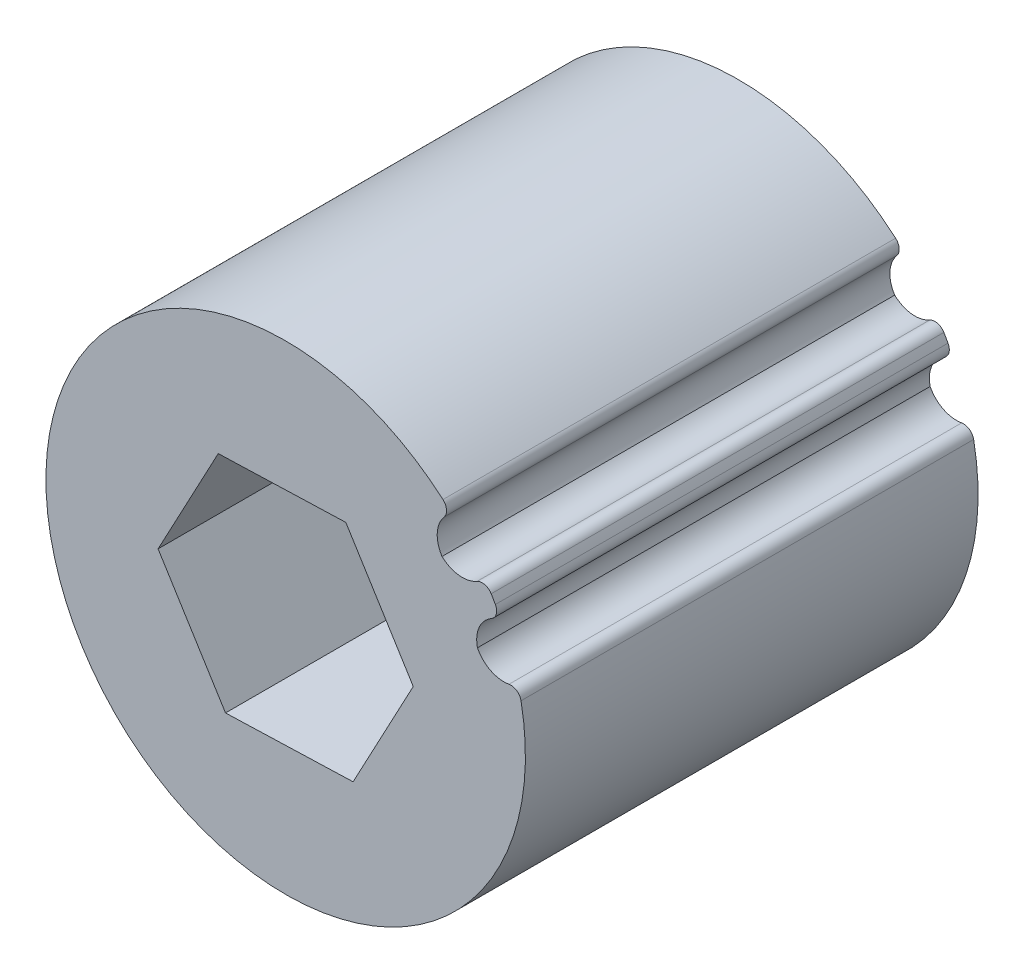
ISO-10303-21;
HEADER;
FILE_DESCRIPTION(('STEP AP214'),'2;1');
FILE_NAME('part.step','',(''),(''),'','','');
FILE_SCHEMA(('AUTOMOTIVE_DESIGN { 1 0 10303 214 1 1 1 1 }'));
ENDSEC;
DATA;
#1=APPLICATION_CONTEXT('core data for automotive mechanical design processes');
#2=APPLICATION_PROTOCOL_DEFINITION('international standard','automotive_design',2000,#1);
#3=PRODUCT_CONTEXT('',#1,'mechanical');
#4=PRODUCT('Part','Part','',(#3));
#5=PRODUCT_RELATED_PRODUCT_CATEGORY('part','',(#4));
#6=PRODUCT_DEFINITION_FORMATION('','',#4);
#7=PRODUCT_DEFINITION_CONTEXT('part definition',#1,'design');
#8=PRODUCT_DEFINITION('design','',#6,#7);
#9=PRODUCT_DEFINITION_SHAPE('','',#8);
#10=(LENGTH_UNIT() NAMED_UNIT(*) SI_UNIT(.MILLI.,.METRE.));
#11=(NAMED_UNIT(*) PLANE_ANGLE_UNIT() SI_UNIT($,.RADIAN.));
#12=(NAMED_UNIT(*) SI_UNIT($,.STERADIAN.) SOLID_ANGLE_UNIT());
#13=UNCERTAINTY_MEASURE_WITH_UNIT(LENGTH_MEASURE(1.E-05),#10,'distance_accuracy_value','');
#14=(GEOMETRIC_REPRESENTATION_CONTEXT(3) GLOBAL_UNCERTAINTY_ASSIGNED_CONTEXT((#13)) GLOBAL_UNIT_ASSIGNED_CONTEXT((#10,
#11,#12)) REPRESENTATION_CONTEXT('',''));
#15=CARTESIAN_POINT('',(0.,0.,0.));
#16=DIRECTION('',(0.,0.,1.));
#17=DIRECTION('',(1.,0.,0.));
#18=AXIS2_PLACEMENT_3D('',#15,#16,#17);
#19=CARTESIAN_POINT('',(0.,0.,-100.));
#20=DIRECTION('',(0.,0.,1.));
#21=DIRECTION('',(1.,0.,0.));
#22=AXIS2_PLACEMENT_3D('',#19,#20,#21);
#23=CYLINDRICAL_SURFACE('',#22,13.77);
#24=DIRECTION('',(0.,0.,1.));
#25=VECTOR('',#24,1.);
#26=CARTESIAN_POINT('',(11.8039555341255,7.09080628338531,100.));
#27=LINE('',#26,#25);
#28=CARTESIAN_POINT('',(11.8039555341241,7.0908062833799,-74.000108));
#29=VERTEX_POINT('',#28);
#30=CARTESIAN_POINT('',(11.8039555341248,7.09080628338263,-100.));
#31=VERTEX_POINT('',#30);
#32=EDGE_CURVE('E193',#29,#31,#27,.F.);
#33=ORIENTED_EDGE('',*,*,#32,.F.);
#34=CARTESIAN_POINT('',(0.,0.,-74.000108));
#35=DIRECTION('',(0.,0.,1.));
#36=DIRECTION('',(1.,0.,0.));
#37=AXIS2_PLACEMENT_3D('',#34,#35,#36);
#38=CIRCLE('',#37,13.7699999999999);
#39=CARTESIAN_POINT('',(12.0427961417845,6.67712221600126,-74.000108));
#40=VERTEX_POINT('',#39);
#41=EDGE_CURVE('E151',#40,#29,#38,.T.);
#42=ORIENTED_EDGE('',*,*,#41,.F.);
#43=DIRECTION('',(0.,0.,1.));
#44=VECTOR('',#43,1.);
#45=CARTESIAN_POINT('',(12.0427961417844,6.67712221600442,100.));
#46=LINE('',#45,#44);
#47=CARTESIAN_POINT('',(12.0427961417845,6.67712221600286,-100.));
#48=VERTEX_POINT('',#47);
#49=EDGE_CURVE('E196',#48,#40,#46,.T.);
#50=ORIENTED_EDGE('',*,*,#49,.F.);
#51=CARTESIAN_POINT('',(0.,0.,-100.));
#52=DIRECTION('',(0.,0.,1.));
#53=DIRECTION('',(1.,0.,0.));
#54=AXIS2_PLACEMENT_3D('',#51,#52,#53);
#55=CIRCLE('',#54,13.77);
#56=EDGE_CURVE('E198',#48,#31,#55,.T.);
#57=ORIENTED_EDGE('',*,*,#56,.T.);
#58=EDGE_LOOP('',(#33,#42,#50,#57));
#59=FACE_BOUND('',#58,.T.);
#60=ADVANCED_FACE('F35',(#59),#23,.T.);
#61=CARTESIAN_POINT('',(11.51893013678,6.386664975088,100.));
#62=DIRECTION('',(0.,0.,1.));
#63=DIRECTION('',(1.,0.,0.));
#64=AXIS2_PLACEMENT_3D('',#61,#62,#63);
#65=CYLINDRICAL_SURFACE('',#64,0.599);
#66=ORIENTED_EDGE('',*,*,#49,.T.);
#67=CARTESIAN_POINT('',(11.51893013678,6.386664975088,-74.000108));
#68=DIRECTION('',(0.,0.,1.));
#69=DIRECTION('',(1.,0.,0.));
#70=AXIS2_PLACEMENT_3D('',#67,#68,#69);
#71=CIRCLE('',#70,0.599);
#72=CARTESIAN_POINT('',(11.8188093902637,5.86813490524408,-74.000108));
#73=VERTEX_POINT('',#72);
#74=EDGE_CURVE('E259',#40,#73,#71,.F.);
#75=ORIENTED_EDGE('',*,*,#74,.T.);
#76=DIRECTION('',(0.,0.,1.));
#77=VECTOR('',#76,1.);
#78=CARTESIAN_POINT('',(11.8188093902618,5.86813490524298,100.));
#79=LINE('',#78,#77);
#80=CARTESIAN_POINT('',(11.8188093902632,5.86813490524489,-100.));
#81=VERTEX_POINT('',#80);
#82=EDGE_CURVE('E185',#73,#81,#79,.F.);
#83=ORIENTED_EDGE('',*,*,#82,.T.);
#84=CARTESIAN_POINT('',(11.51893013678,6.386664975088,-100.));
#85=DIRECTION('',(0.,0.,1.));
#86=DIRECTION('',(1.,0.,0.));
#87=AXIS2_PLACEMENT_3D('',#84,#85,#86);
#88=CIRCLE('',#87,0.599);
#89=EDGE_CURVE('E195',#81,#48,#88,.T.);
#90=ORIENTED_EDGE('',*,*,#89,.T.);
#91=EDGE_LOOP('',(#66,#75,#83,#90));
#92=FACE_BOUND('',#91,.T.);
#93=ADVANCED_FACE('F287',(#92),#65,.T.);
#94=CARTESIAN_POINT('',(11.29047918228,6.782353635325,100.));
#95=DIRECTION('',(0.,0.,1.));
#96=DIRECTION('',(1.,0.,0.));
#97=AXIS2_PLACEMENT_3D('',#94,#95,#96);
#98=CYLINDRICAL_SURFACE('',#97,0.599);
#99=DIRECTION('',(0.,0.,1.));
#100=VECTOR('',#99,1.);
#101=CARTESIAN_POINT('',(10.9913585959105,7.30132172183021,100.));
#102=LINE('',#101,#100);
#103=CARTESIAN_POINT('',(10.9913585959116,7.30132172183042,-100.));
#104=VERTEX_POINT('',#103);
#105=CARTESIAN_POINT('',(10.9913585959114,7.30132172183076,-74.000108));
#106=VERTEX_POINT('',#105);
#107=EDGE_CURVE('E182',#104,#106,#102,.T.);
#108=ORIENTED_EDGE('',*,*,#107,.T.);
#109=CARTESIAN_POINT('',(11.29047918228,6.782353635325,-74.000108));
#110=DIRECTION('',(0.,0.,1.));
#111=DIRECTION('',(1.,0.,0.));
#112=AXIS2_PLACEMENT_3D('',#109,#110,#111);
#113=CIRCLE('',#112,0.599);
#114=EDGE_CURVE('E162',#106,#29,#113,.F.);
#115=ORIENTED_EDGE('',*,*,#114,.T.);
#116=ORIENTED_EDGE('',*,*,#32,.T.);
#117=CARTESIAN_POINT('',(11.29047918228,6.782353635325,-100.));
#118=DIRECTION('',(0.,0.,1.));
#119=DIRECTION('',(1.,0.,0.));
#120=AXIS2_PLACEMENT_3D('',#117,#118,#119);
#121=CIRCLE('',#120,0.599);
#122=EDGE_CURVE('E189',#31,#104,#121,.T.);
#123=ORIENTED_EDGE('',*,*,#122,.T.);
#124=EDGE_LOOP('',(#108,#115,#116,#123));
#125=FACE_BOUND('',#124,.T.);
#126=ADVANCED_FACE('F284',(#125),#98,.T.);
#127=CARTESIAN_POINT('',(12.53189300495,4.775135765078,100.));
#128=DIRECTION('',(0.,0.,1.));
#129=DIRECTION('',(1.,0.,0.));
#130=AXIS2_PLACEMENT_3D('',#127,#128,#129);
#131=CYLINDRICAL_SURFACE('',#130,1.699);
#132=CARTESIAN_POINT('',(12.53189300495,4.775135765078,-74.000108));
#133=DIRECTION('',(0.,0.,1.));
#134=DIRECTION('',(1.,0.,0.));
#135=AXIS2_PLACEMENT_3D('',#132,#133,#134);
#136=CIRCLE('',#135,1.699);
#137=CARTESIAN_POINT('',(12.8256976667523,3.10173210167148,-74.000108));
#138=VERTEX_POINT('',#137);
#139=CARTESIAN_POINT('',(11.0153132679989,4.00924615066258,-74.000108));
#140=VERTEX_POINT('',#139);
#141=EDGE_CURVE('E161',#138,#140,#136,.F.);
#142=ORIENTED_EDGE('',*,*,#141,.F.);
#143=DIRECTION('',(0.,0.,1.));
#144=VECTOR('',#143,1.);
#145=CARTESIAN_POINT('',(12.8256976667502,3.10173210167109,100.));
#146=LINE('',#145,#144);
#147=CARTESIAN_POINT('',(12.8256976667524,3.10173210167135,-100.));
#148=VERTEX_POINT('',#147);
#149=EDGE_CURVE('E160',#148,#138,#146,.T.);
#150=ORIENTED_EDGE('',*,*,#149,.F.);
#151=CARTESIAN_POINT('',(12.53189300495,4.775135765078,-100.));
#152=DIRECTION('',(0.,0.,1.));
#153=DIRECTION('',(1.,0.,0.));
#154=AXIS2_PLACEMENT_3D('',#151,#152,#153);
#155=CIRCLE('',#154,1.699);
#156=CARTESIAN_POINT('',(11.0153132680004,4.00924615066331,-100.));
#157=VERTEX_POINT('',#156);
#158=EDGE_CURVE('E181',#148,#157,#155,.F.);
#159=ORIENTED_EDGE('',*,*,#158,.T.);
#160=DIRECTION('',(0.,0.,1.));
#161=VECTOR('',#160,1.);
#162=CARTESIAN_POINT('',(11.0153132679988,4.00924615067006,100.));
#163=LINE('',#162,#161);
#164=EDGE_CURVE('E186',#157,#140,#163,.T.);
#165=ORIENTED_EDGE('',*,*,#164,.T.);
#166=EDGE_LOOP('',(#142,#150,#159,#165));
#167=FACE_BOUND('',#166,.T.);
#168=ADVANCED_FACE('F295',(#167),#131,.F.);
#169=CARTESIAN_POINT('',(12.66938510257,4.397379331522,100.));
#170=DIRECTION('',(0.,0.,1.));
#171=DIRECTION('',(1.,0.,0.));
#172=AXIS2_PLACEMENT_3D('',#169,#170,#171);
#173=CYLINDRICAL_SURFACE('',#172,1.699);
#174=CARTESIAN_POINT('',(12.66938510257,4.397379331522,-74.000108));
#175=DIRECTION('',(0.,0.,1.));
#176=DIRECTION('',(1.,0.,0.));
#177=AXIS2_PLACEMENT_3D('',#174,#175,#176);
#178=CIRCLE('',#177,1.699);
#179=EDGE_CURVE('E262',#140,#73,#178,.F.);
#180=ORIENTED_EDGE('',*,*,#179,.F.);
#181=ORIENTED_EDGE('',*,*,#164,.F.);
#182=CARTESIAN_POINT('',(12.66938510257,4.397379331522,-100.));
#183=DIRECTION('',(0.,0.,1.));
#184=DIRECTION('',(1.,0.,0.));
#185=AXIS2_PLACEMENT_3D('',#182,#183,#184);
#186=CIRCLE('',#185,1.699);
#187=EDGE_CURVE('E207',#157,#81,#186,.F.);
#188=ORIENTED_EDGE('',*,*,#187,.T.);
#189=ORIENTED_EDGE('',*,*,#82,.F.);
#190=EDGE_LOOP('',(#180,#181,#188,#189));
#191=FACE_BOUND('',#190,.T.);
#192=ADVANCED_FACE('F300',(#191),#173,.F.);
#193=CARTESIAN_POINT('',(10.14293476246,8.773319683389,100.));
#194=DIRECTION('',(0.,0.,1.));
#195=DIRECTION('',(1.,0.,0.));
#196=AXIS2_PLACEMENT_3D('',#193,#194,#195);
#197=CYLINDRICAL_SURFACE('',#196,1.699);
#198=CARTESIAN_POINT('',(10.14293476246,8.773319683389,-74.000108));
#199=DIRECTION('',(0.,0.,1.));
#200=DIRECTION('',(1.,0.,0.));
#201=AXIS2_PLACEMENT_3D('',#198,#199,#200);
#202=CIRCLE('',#201,1.699);
#203=CARTESIAN_POINT('',(8.97976565049617,7.53491804539816,-74.000108));
#204=VERTEX_POINT('',#203);
#205=EDGE_CURVE('E267',#106,#204,#202,.F.);
#206=ORIENTED_EDGE('',*,*,#205,.F.);
#207=ORIENTED_EDGE('',*,*,#107,.F.);
#208=CARTESIAN_POINT('',(10.14293476246,8.773319683389,-100.));
#209=DIRECTION('',(0.,0.,1.));
#210=DIRECTION('',(1.,0.,0.));
#211=AXIS2_PLACEMENT_3D('',#208,#209,#210);
#212=CIRCLE('',#211,1.699);
#213=CARTESIAN_POINT('',(8.97976565049617,7.53491804539816,-100.));
#214=VERTEX_POINT('',#213);
#215=EDGE_CURVE('E205',#104,#214,#212,.F.);
#216=ORIENTED_EDGE('',*,*,#215,.T.);
#217=DIRECTION('',(0.,0.,1.));
#218=VECTOR('',#217,1.);
#219=CARTESIAN_POINT('',(8.97976565049968,7.53491804539279,100.));
#220=LINE('',#219,#218);
#221=EDGE_CURVE('E178',#214,#204,#220,.T.);
#222=ORIENTED_EDGE('',*,*,#221,.T.);
#223=EDGE_LOOP('',(#206,#207,#216,#222));
#224=FACE_BOUND('',#223,.T.);
#225=ADVANCED_FACE('F304',(#224),#197,.F.);
#226=CARTESIAN_POINT('',(10.40133538155,8.465369817255,100.));
#227=DIRECTION('',(0.,0.,1.));
#228=DIRECTION('',(1.,0.,0.));
#229=AXIS2_PLACEMENT_3D('',#226,#227,#228);
#230=CYLINDRICAL_SURFACE('',#229,1.699);
#231=CARTESIAN_POINT('',(10.40133538155,8.465369817255,-74.000108));
#232=DIRECTION('',(0.,0.,1.));
#233=DIRECTION('',(1.,0.,0.));
#234=AXIS2_PLACEMENT_3D('',#231,#232,#233);
#235=CIRCLE('',#234,1.699);
#236=CARTESIAN_POINT('',(9.09902762915831,9.55651394983198,-74.000108));
#237=VERTEX_POINT('',#236);
#238=EDGE_CURVE('E269',#204,#237,#235,.F.);
#239=ORIENTED_EDGE('',*,*,#238,.F.);
#240=ORIENTED_EDGE('',*,*,#221,.F.);
#241=CARTESIAN_POINT('',(10.40133538155,8.465369817255,-100.));
#242=DIRECTION('',(0.,0.,1.));
#243=DIRECTION('',(1.,0.,0.));
#244=AXIS2_PLACEMENT_3D('',#241,#242,#243);
#245=CIRCLE('',#244,1.699);
#246=CARTESIAN_POINT('',(9.09902762915794,9.55651394983229,-100.));
#247=VERTEX_POINT('',#246);
#248=EDGE_CURVE('E192',#214,#247,#245,.F.);
#249=ORIENTED_EDGE('',*,*,#248,.T.);
#250=DIRECTION('',(0.,0.,1.));
#251=VECTOR('',#250,1.);
#252=CARTESIAN_POINT('',(9.0990276291582,9.55651394983184,100.));
#253=LINE('',#252,#251);
#254=EDGE_CURVE('E175',#237,#247,#253,.F.);
#255=ORIENTED_EDGE('',*,*,#254,.F.);
#256=EDGE_LOOP('',(#239,#240,#249,#255));
#257=FACE_BOUND('',#256,.T.);
#258=ADVANCED_FACE('F308',(#257),#230,.F.);
#259=CARTESIAN_POINT('',(12.92928153516,2.511756354538,100.));
#260=DIRECTION('',(0.,0.,1.));
#261=DIRECTION('',(1.,0.,0.));
#262=AXIS2_PLACEMENT_3D('',#259,#260,#261);
#263=CYLINDRICAL_SURFACE('',#262,0.599);
#264=ORIENTED_EDGE('',*,*,#149,.T.);
#265=CARTESIAN_POINT('',(12.92928153516,2.511756354538,-74.000108));
#266=DIRECTION('',(0.,0.,1.));
#267=DIRECTION('',(1.,0.,0.));
#268=AXIS2_PLACEMENT_3D('',#265,#266,#267);
#269=CIRCLE('',#268,0.599);
#270=CARTESIAN_POINT('',(13.5172884928371,2.62598777632569,-74.000108));
#271=VERTEX_POINT('',#270);
#272=EDGE_CURVE('E146',#138,#271,#269,.F.);
#273=ORIENTED_EDGE('',*,*,#272,.T.);
#274=DIRECTION('',(0.,0.,1.));
#275=VECTOR('',#274,1.);
#276=CARTESIAN_POINT('',(13.5172884928372,2.62598777632546,-100.));
#277=LINE('',#276,#275);
#278=CARTESIAN_POINT('',(13.517288492837,2.62598777632567,-100.));
#279=VERTEX_POINT('',#278);
#280=EDGE_CURVE('E158',#279,#271,#277,.T.);
#281=ORIENTED_EDGE('',*,*,#280,.F.);
#282=CARTESIAN_POINT('',(12.92928153516,2.511756354538,-100.));
#283=DIRECTION('',(0.,0.,1.));
#284=DIRECTION('',(1.,0.,0.));
#285=AXIS2_PLACEMENT_3D('',#282,#283,#284);
#286=CIRCLE('',#285,0.599);
#287=EDGE_CURVE('E177',#279,#148,#286,.T.);
#288=ORIENTED_EDGE('',*,*,#287,.T.);
#289=EDGE_LOOP('',(#264,#273,#281,#288));
#290=FACE_BOUND('',#289,.T.);
#291=ADVANCED_FACE('F156',(#290),#263,.T.);
#292=CARTESIAN_POINT('',(8.639885578727,9.941208084861,100.));
#293=DIRECTION('',(0.,0.,1.));
#294=DIRECTION('',(1.,0.,0.));
#295=AXIS2_PLACEMENT_3D('',#292,#293,#294);
#296=CYLINDRICAL_SURFACE('',#295,0.599);
#297=DIRECTION('',(0.,0.,1.));
#298=VECTOR('',#297,1.);
#299=CARTESIAN_POINT('',(9.03281637074264,10.3933213369184,-100.));
#300=LINE('',#299,#298);
#301=CARTESIAN_POINT('',(9.03281637074264,10.3933213369184,-74.000108));
#302=VERTEX_POINT('',#301);
#303=CARTESIAN_POINT('',(9.03281637074337,10.3933213369178,-100.));
#304=VERTEX_POINT('',#303);
#305=EDGE_CURVE('E42',#302,#304,#300,.F.);
#306=ORIENTED_EDGE('',*,*,#305,.F.);
#307=CARTESIAN_POINT('',(8.639885578727,9.941208084861,-74.000108));
#308=DIRECTION('',(0.,0.,1.));
#309=DIRECTION('',(1.,0.,0.));
#310=AXIS2_PLACEMENT_3D('',#307,#308,#309);
#311=CIRCLE('',#310,0.599);
#312=EDGE_CURVE('E49',#302,#237,#311,.F.);
#313=ORIENTED_EDGE('',*,*,#312,.T.);
#314=ORIENTED_EDGE('',*,*,#254,.T.);
#315=CARTESIAN_POINT('',(8.639885578727,9.941208084861,-100.));
#316=DIRECTION('',(0.,0.,1.));
#317=DIRECTION('',(1.,0.,0.));
#318=AXIS2_PLACEMENT_3D('',#315,#316,#317);
#319=CIRCLE('',#318,0.599);
#320=EDGE_CURVE('E169',#247,#304,#319,.T.);
#321=ORIENTED_EDGE('',*,*,#320,.T.);
#322=EDGE_LOOP('',(#306,#313,#314,#321));
#323=FACE_BOUND('',#322,.T.);
#324=ADVANCED_FACE('F320',(#323),#296,.T.);
#325=CARTESIAN_POINT('',(0.,0.,-100.));
#326=DIRECTION('',(0.,0.,1.));
#327=DIRECTION('',(1.,0.,0.));
#328=AXIS2_PLACEMENT_3D('',#325,#326,#327);
#329=CYLINDRICAL_SURFACE('',#328,13.77);
#330=ORIENTED_EDGE('',*,*,#280,.T.);
#331=EDGE_CURVE('E143',#302,#271,#38,.T.);
#332=ORIENTED_EDGE('',*,*,#331,.F.);
#333=ORIENTED_EDGE('',*,*,#305,.T.);
#334=CARTESIAN_POINT('',(0.,0.,-100.));
#335=DIRECTION('',(0.,0.,1.));
#336=DIRECTION('',(1.,0.,0.));
#337=AXIS2_PLACEMENT_3D('',#334,#335,#336);
#338=CIRCLE('',#337,13.77);
#339=EDGE_CURVE('E166',#304,#279,#338,.T.);
#340=ORIENTED_EDGE('',*,*,#339,.T.);
#341=EDGE_LOOP('',(#330,#332,#333,#340));
#342=FACE_BOUND('',#341,.T.);
#343=ADVANCED_FACE('F164',(#342),#329,.T.);
#344=CARTESIAN_POINT('',(3.87264973544037,-6.22622818084328,154.));
#345=DIRECTION('',(0.0328269943930476,-0.999461048985461,0.));
#346=DIRECTION('',(0.999461048985461,0.0328269943930476,0.));
#347=AXIS2_PLACEMENT_3D('',#344,#345,#346);
#348=PLANE('',#347);
#349=DIRECTION('',(-0.999461048985461,-0.0328269943930476,0.));
#350=VECTOR('',#349,1.);
#351=CARTESIAN_POINT('',(3.87264973544037,-6.22622818084328,-74.000108));
#352=LINE('',#351,#350);
#353=CARTESIAN_POINT('',(3.87264973544037,-6.22622818084328,-74.000108));
#354=VERTEX_POINT('',#353);
#355=CARTESIAN_POINT('',(-3.45574690664867,-6.46692714127208,-74.000108));
#356=VERTEX_POINT('',#355);
#357=EDGE_CURVE('E56',#354,#356,#352,.T.);
#358=ORIENTED_EDGE('',*,*,#357,.F.);
#359=DIRECTION('',(0.,0.,-1.));
#360=VECTOR('',#359,1.);
#361=CARTESIAN_POINT('',(3.87264973544037,-6.22622818084328,154.));
#362=LINE('',#361,#360);
#363=CARTESIAN_POINT('',(3.87264973544037,-6.22622818084328,-100.));
#364=VERTEX_POINT('',#363);
#365=EDGE_CURVE('E214',#354,#364,#362,.T.);
#366=ORIENTED_EDGE('',*,*,#365,.T.);
#367=DIRECTION('',(-0.999461048985461,-0.0328269943930476,0.));
#368=VECTOR('',#367,1.);
#369=CARTESIAN_POINT('',(3.87264973544037,-6.22622818084328,-100.));
#370=LINE('',#369,#368);
#371=CARTESIAN_POINT('',(-3.45574690664867,-6.46692714127208,-100.));
#372=VERTEX_POINT('',#371);
#373=EDGE_CURVE('E257',#364,#372,#370,.T.);
#374=ORIENTED_EDGE('',*,*,#373,.T.);
#375=DIRECTION('',(0.,0.,-1.));
#376=VECTOR('',#375,1.);
#377=CARTESIAN_POINT('',(-3.45574690664867,-6.46692714127208,154.));
#378=LINE('',#377,#376);
#379=EDGE_CURVE('E172',#356,#372,#378,.T.);
#380=ORIENTED_EDGE('',*,*,#379,.F.);
#381=EDGE_LOOP('',(#358,#366,#374,#380));
#382=FACE_BOUND('',#381,.T.);
#383=ADVANCED_FACE('F326',(#382),#348,.F.);
#384=CARTESIAN_POINT('',(7.32839664208904,0.240698960428808,154.));
#385=DIRECTION('',(0.881972155710977,-0.471301513418462,0.));
#386=DIRECTION('',(0.471301513418462,0.881972155710977,0.));
#387=AXIS2_PLACEMENT_3D('',#384,#385,#386);
#388=PLANE('',#387);
#389=DIRECTION('',(-0.471301513418462,-0.881972155710977,0.));
#390=VECTOR('',#389,1.);
#391=CARTESIAN_POINT('',(7.32839664208904,0.240698960428808,-74.000108));
#392=LINE('',#391,#390);
#393=CARTESIAN_POINT('',(7.32839664208904,0.240698960428809,-74.000108));
#394=VERTEX_POINT('',#393);
#395=EDGE_CURVE('E273',#394,#354,#392,.T.);
#396=ORIENTED_EDGE('',*,*,#395,.F.);
#397=DIRECTION('',(0.,0.,-1.));
#398=VECTOR('',#397,1.);
#399=CARTESIAN_POINT('',(7.32839664208904,0.240698960428808,154.));
#400=LINE('',#399,#398);
#401=CARTESIAN_POINT('',(7.32839664208904,0.240698960428808,-100.));
#402=VERTEX_POINT('',#401);
#403=EDGE_CURVE('E219',#394,#402,#400,.T.);
#404=ORIENTED_EDGE('',*,*,#403,.T.);
#405=DIRECTION('',(-0.471301513418462,-0.881972155710977,0.));
#406=VECTOR('',#405,1.);
#407=CARTESIAN_POINT('',(7.32839664208904,0.240698960428808,-100.));
#408=LINE('',#407,#406);
#409=EDGE_CURVE('E228',#402,#364,#408,.T.);
#410=ORIENTED_EDGE('',*,*,#409,.T.);
#411=ORIENTED_EDGE('',*,*,#365,.F.);
#412=EDGE_LOOP('',(#396,#404,#410,#411));
#413=FACE_BOUND('',#412,.T.);
#414=ADVANCED_FACE('F329',(#413),#388,.F.);
#415=CARTESIAN_POINT('',(3.45574690664867,6.46692714127208,154.));
#416=DIRECTION('',(0.849145161317929,0.528159535566999,0.));
#417=DIRECTION('',(-0.528159535566999,0.849145161317929,0.));
#418=AXIS2_PLACEMENT_3D('',#415,#416,#417);
#419=PLANE('',#418);
#420=DIRECTION('',(0.528159535566999,-0.849145161317929,0.));
#421=VECTOR('',#420,1.);
#422=CARTESIAN_POINT('',(3.45574690664867,6.46692714127208,-74.000108));
#423=LINE('',#422,#421);
#424=CARTESIAN_POINT('',(3.45574690664867,6.46692714127208,-74.000108));
#425=VERTEX_POINT('',#424);
#426=EDGE_CURVE('E275',#425,#394,#423,.T.);
#427=ORIENTED_EDGE('',*,*,#426,.F.);
#428=DIRECTION('',(0.,0.,-1.));
#429=VECTOR('',#428,1.);
#430=CARTESIAN_POINT('',(3.45574690664867,6.46692714127208,154.));
#431=LINE('',#430,#429);
#432=CARTESIAN_POINT('',(3.45574690664867,6.46692714127208,-100.));
#433=VERTEX_POINT('',#432);
#434=EDGE_CURVE('E225',#425,#433,#431,.T.);
#435=ORIENTED_EDGE('',*,*,#434,.T.);
#436=DIRECTION('',(0.528159535566999,-0.849145161317929,0.));
#437=VECTOR('',#436,1.);
#438=CARTESIAN_POINT('',(3.45574690664867,6.46692714127208,-100.));
#439=LINE('',#438,#437);
#440=EDGE_CURVE('E241',#433,#402,#439,.T.);
#441=ORIENTED_EDGE('',*,*,#440,.T.);
#442=ORIENTED_EDGE('',*,*,#403,.F.);
#443=EDGE_LOOP('',(#427,#435,#441,#442));
#444=FACE_BOUND('',#443,.T.);
#445=ADVANCED_FACE('F338',(#444),#419,.F.);
#446=CARTESIAN_POINT('',(-3.87264973544037,6.22622818084328,154.));
#447=DIRECTION('',(-0.0328269943930475,0.999461048985461,0.));
#448=DIRECTION('',(-0.999461048985461,-0.0328269943930475,0.));
#449=AXIS2_PLACEMENT_3D('',#446,#447,#448);
#450=PLANE('',#449);
#451=DIRECTION('',(0.999461048985461,0.0328269943930475,0.));
#452=VECTOR('',#451,1.);
#453=CARTESIAN_POINT('',(-3.87264973544037,6.22622818084328,-74.000108));
#454=LINE('',#453,#452);
#455=CARTESIAN_POINT('',(-3.87264973544037,6.22622818084328,-74.000108));
#456=VERTEX_POINT('',#455);
#457=EDGE_CURVE('E277',#456,#425,#454,.T.);
#458=ORIENTED_EDGE('',*,*,#457,.F.);
#459=DIRECTION('',(0.,0.,-1.));
#460=VECTOR('',#459,1.);
#461=CARTESIAN_POINT('',(-3.87264973544037,6.22622818084328,154.));
#462=LINE('',#461,#460);
#463=CARTESIAN_POINT('',(-3.87264973544037,6.22622818084328,-100.));
#464=VERTEX_POINT('',#463);
#465=EDGE_CURVE('E232',#456,#464,#462,.T.);
#466=ORIENTED_EDGE('',*,*,#465,.T.);
#467=DIRECTION('',(0.999461048985461,0.0328269943930474,0.));
#468=VECTOR('',#467,1.);
#469=CARTESIAN_POINT('',(-3.87264973544037,6.22622818084328,-100.));
#470=LINE('',#469,#468);
#471=EDGE_CURVE('E246',#464,#433,#470,.T.);
#472=ORIENTED_EDGE('',*,*,#471,.T.);
#473=ORIENTED_EDGE('',*,*,#434,.F.);
#474=EDGE_LOOP('',(#458,#466,#472,#473));
#475=FACE_BOUND('',#474,.T.);
#476=ADVANCED_FACE('F335',(#475),#450,.F.);
#477=CARTESIAN_POINT('',(-7.32839664208904,-0.240698960428807,154.));
#478=DIRECTION('',(-0.881972155710976,0.471301513418462,0.));
#479=DIRECTION('',(-0.471301513418462,-0.881972155710977,0.));
#480=AXIS2_PLACEMENT_3D('',#477,#478,#479);
#481=PLANE('',#480);
#482=DIRECTION('',(0.471301513418462,0.881972155710977,0.));
#483=VECTOR('',#482,1.);
#484=CARTESIAN_POINT('',(-7.32839664208904,-0.240698960428807,-74.000108));
#485=LINE('',#484,#483);
#486=CARTESIAN_POINT('',(-7.32839664208904,-0.240698960428808,-74.000108));
#487=VERTEX_POINT('',#486);
#488=EDGE_CURVE('E279',#487,#456,#485,.T.);
#489=ORIENTED_EDGE('',*,*,#488,.F.);
#490=DIRECTION('',(0.,0.,-1.));
#491=VECTOR('',#490,1.);
#492=CARTESIAN_POINT('',(-7.32839664208904,-0.240698960428807,154.));
#493=LINE('',#492,#491);
#494=CARTESIAN_POINT('',(-7.32839664208904,-0.240698960428807,-100.));
#495=VERTEX_POINT('',#494);
#496=EDGE_CURVE('E233',#487,#495,#493,.T.);
#497=ORIENTED_EDGE('',*,*,#496,.T.);
#498=DIRECTION('',(0.471301513418462,0.881972155710977,0.));
#499=VECTOR('',#498,1.);
#500=CARTESIAN_POINT('',(-7.32839664208904,-0.240698960428807,-100.));
#501=LINE('',#500,#499);
#502=EDGE_CURVE('E251',#495,#464,#501,.T.);
#503=ORIENTED_EDGE('',*,*,#502,.T.);
#504=ORIENTED_EDGE('',*,*,#465,.F.);
#505=EDGE_LOOP('',(#489,#497,#503,#504));
#506=FACE_BOUND('',#505,.T.);
#507=ADVANCED_FACE('F332',(#506),#481,.F.);
#508=CARTESIAN_POINT('',(-3.45574690664867,-6.46692714127208,154.));
#509=DIRECTION('',(-0.849145161317929,-0.528159535566999,0.));
#510=DIRECTION('',(0.528159535566999,-0.849145161317929,0.));
#511=AXIS2_PLACEMENT_3D('',#508,#509,#510);
#512=PLANE('',#511);
#513=DIRECTION('',(-0.528159535566999,0.849145161317929,0.));
#514=VECTOR('',#513,1.);
#515=CARTESIAN_POINT('',(-3.45574690664867,-6.46692714127208,-74.000108));
#516=LINE('',#515,#514);
#517=EDGE_CURVE('E11',#356,#487,#516,.T.);
#518=ORIENTED_EDGE('',*,*,#517,.F.);
#519=ORIENTED_EDGE('',*,*,#379,.T.);
#520=DIRECTION('',(-0.528159535566999,0.849145161317929,0.));
#521=VECTOR('',#520,1.);
#522=CARTESIAN_POINT('',(-3.45574690664867,-6.46692714127208,-100.));
#523=LINE('',#522,#521);
#524=EDGE_CURVE('E255',#372,#495,#523,.T.);
#525=ORIENTED_EDGE('',*,*,#524,.T.);
#526=ORIENTED_EDGE('',*,*,#496,.F.);
#527=EDGE_LOOP('',(#518,#519,#525,#526));
#528=FACE_BOUND('',#527,.T.);
#529=ADVANCED_FACE('F316',(#528),#512,.F.);
#530=CARTESIAN_POINT('',(0.,0.,-100.));
#531=DIRECTION('',(0.,0.,1.));
#532=DIRECTION('',(1.,0.,0.));
#533=AXIS2_PLACEMENT_3D('',#530,#531,#532);
#534=PLANE('',#533);
#535=ORIENTED_EDGE('',*,*,#524,.F.);
#536=ORIENTED_EDGE('',*,*,#373,.F.);
#537=ORIENTED_EDGE('',*,*,#409,.F.);
#538=ORIENTED_EDGE('',*,*,#440,.F.);
#539=ORIENTED_EDGE('',*,*,#471,.F.);
#540=ORIENTED_EDGE('',*,*,#502,.F.);
#541=EDGE_LOOP('',(#535,#536,#537,#538,#539,#540));
#542=FACE_BOUND('',#541,.T.);
#543=ORIENTED_EDGE('',*,*,#215,.F.);
#544=ORIENTED_EDGE('',*,*,#122,.F.);
#545=ORIENTED_EDGE('',*,*,#56,.F.);
#546=ORIENTED_EDGE('',*,*,#89,.F.);
#547=ORIENTED_EDGE('',*,*,#187,.F.);
#548=ORIENTED_EDGE('',*,*,#158,.F.);
#549=ORIENTED_EDGE('',*,*,#287,.F.);
#550=ORIENTED_EDGE('',*,*,#339,.F.);
#551=ORIENTED_EDGE('',*,*,#320,.F.);
#552=ORIENTED_EDGE('',*,*,#248,.F.);
#553=EDGE_LOOP('',(#543,#544,#545,#546,#547,#548,#549,#550,#551,#552));
#554=FACE_BOUND('',#553,.T.);
#555=ADVANCED_FACE('F313',(#542,#554),#534,.F.);
#556=CARTESIAN_POINT('',(0.,0.,-74.000108));
#557=DIRECTION('',(0.,0.,1.));
#558=DIRECTION('',(1.,0.,0.));
#559=AXIS2_PLACEMENT_3D('',#556,#557,#558);
#560=PLANE('',#559);
#561=ORIENTED_EDGE('',*,*,#41,.T.);
#562=ORIENTED_EDGE('',*,*,#114,.F.);
#563=ORIENTED_EDGE('',*,*,#205,.T.);
#564=ORIENTED_EDGE('',*,*,#238,.T.);
#565=ORIENTED_EDGE('',*,*,#312,.F.);
#566=ORIENTED_EDGE('',*,*,#331,.T.);
#567=ORIENTED_EDGE('',*,*,#272,.F.);
#568=ORIENTED_EDGE('',*,*,#141,.T.);
#569=ORIENTED_EDGE('',*,*,#179,.T.);
#570=ORIENTED_EDGE('',*,*,#74,.F.);
#571=EDGE_LOOP('',(#561,#562,#563,#564,#565,#566,#567,#568,#569,#570));
#572=FACE_BOUND('',#571,.T.);
#573=ORIENTED_EDGE('',*,*,#357,.T.);
#574=ORIENTED_EDGE('',*,*,#517,.T.);
#575=ORIENTED_EDGE('',*,*,#488,.T.);
#576=ORIENTED_EDGE('',*,*,#457,.T.);
#577=ORIENTED_EDGE('',*,*,#426,.T.);
#578=ORIENTED_EDGE('',*,*,#395,.T.);
#579=EDGE_LOOP('',(#573,#574,#575,#576,#577,#578));
#580=FACE_BOUND('',#579,.T.);
#581=ADVANCED_FACE('F145',(#572,#580),#560,.T.);
#582=CLOSED_SHELL('',(#60,#93,#126,#168,#192,#225,#258,#291,#324,#343,#383,#414,#445,#476,#507,
#529,#555,#581));
#583=MANIFOLD_SOLID_BREP('B2',#582);
#584=ADVANCED_BREP_SHAPE_REPRESENTATION('',(#18,#583),#14);
#585=SHAPE_DEFINITION_REPRESENTATION(#9,#584);
ENDSEC;
END-ISO-10303-21;
